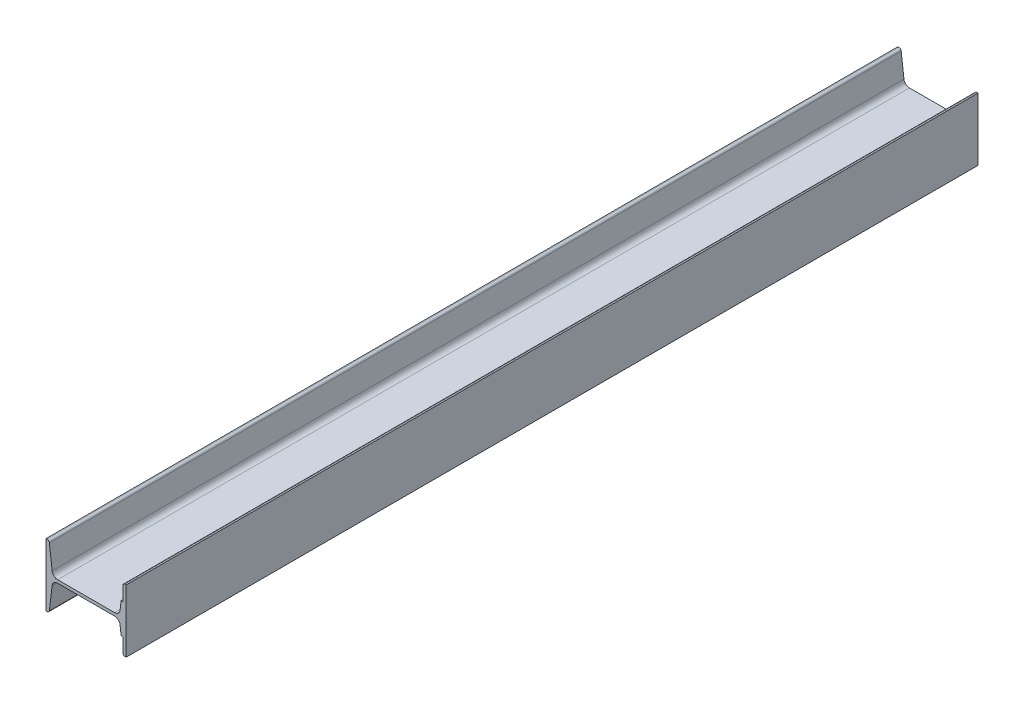
ISO-10303-21;
HEADER;
FILE_DESCRIPTION(('STEP AP214'),'2;1');
FILE_NAME('part.step','',(''),(''),'','','');
FILE_SCHEMA(('AUTOMOTIVE_DESIGN { 1 0 10303 214 1 1 1 1 }'));
ENDSEC;
DATA;
#1=APPLICATION_CONTEXT('core data for automotive mechanical design processes');
#2=APPLICATION_PROTOCOL_DEFINITION('international standard','automotive_design',2000,#1);
#3=PRODUCT_CONTEXT('',#1,'mechanical');
#4=PRODUCT('Part','Part','',(#3));
#5=PRODUCT_RELATED_PRODUCT_CATEGORY('part','',(#4));
#6=PRODUCT_DEFINITION_FORMATION('','',#4);
#7=PRODUCT_DEFINITION_CONTEXT('part definition',#1,'design');
#8=PRODUCT_DEFINITION('design','',#6,#7);
#9=PRODUCT_DEFINITION_SHAPE('','',#8);
#10=(LENGTH_UNIT() NAMED_UNIT(*) SI_UNIT(.MILLI.,.METRE.));
#11=(NAMED_UNIT(*) PLANE_ANGLE_UNIT() SI_UNIT($,.RADIAN.));
#12=(NAMED_UNIT(*) SI_UNIT($,.STERADIAN.) SOLID_ANGLE_UNIT());
#13=UNCERTAINTY_MEASURE_WITH_UNIT(LENGTH_MEASURE(1.E-05),#10,'distance_accuracy_value','');
#14=(GEOMETRIC_REPRESENTATION_CONTEXT(3) GLOBAL_UNCERTAINTY_ASSIGNED_CONTEXT((#13)) GLOBAL_UNIT_ASSIGNED_CONTEXT((#10,
#11,#12)) REPRESENTATION_CONTEXT('',''));
#15=CARTESIAN_POINT('',(0.,0.,0.));
#16=DIRECTION('',(0.,0.,1.));
#17=DIRECTION('',(1.,0.,0.));
#18=AXIS2_PLACEMENT_3D('',#15,#16,#17);
#19=CARTESIAN_POINT('',(112.531380140605,43.4991893124391,312.5));
#20=DIRECTION('',(0.,0.,1.));
#21=DIRECTION('',(1.,0.,0.));
#22=AXIS2_PLACEMENT_3D('',#19,#20,#21);
#23=CYLINDRICAL_SURFACE('',#22,3.3749999999963);
#24=CARTESIAN_POINT('',(112.531380140605,43.4991893124391,1587.5));
#25=DIRECTION('',(0.,0.,1.));
#26=DIRECTION('',(1.,0.,0.));
#27=AXIS2_PLACEMENT_3D('',#24,#25,#26);
#28=CIRCLE('',#27,3.3749999999963);
#29=CARTESIAN_POINT('',(112.531380140605,46.8741893124354,1587.5));
#30=VERTEX_POINT('',#29);
#31=CARTESIAN_POINT('',(109.709666996377,45.3508264074622,1587.5));
#32=VERTEX_POINT('',#31);
#33=EDGE_CURVE('E228',#30,#32,#28,.T.);
#34=ORIENTED_EDGE('',*,*,#33,.F.);
#35=DIRECTION('',(0.,0.,1.));
#36=VECTOR('',#35,1.);
#37=CARTESIAN_POINT('',(112.531380140605,46.8741893124354,312.5));
#38=LINE('',#37,#36);
#39=CARTESIAN_POINT('',(112.531380140605,46.8741893124354,312.5));
#40=VERTEX_POINT('',#39);
#41=EDGE_CURVE('E11',#40,#30,#38,.T.);
#42=ORIENTED_EDGE('',*,*,#41,.F.);
#43=CARTESIAN_POINT('',(112.531380140605,43.4991893124391,312.5));
#44=DIRECTION('',(0.,0.,1.));
#45=DIRECTION('',(1.,0.,0.));
#46=AXIS2_PLACEMENT_3D('',#43,#44,#45);
#47=CIRCLE('',#46,3.3749999999963);
#48=CARTESIAN_POINT('',(109.709666996377,45.3508264074622,312.5));
#49=VERTEX_POINT('',#48);
#50=EDGE_CURVE('E296',#40,#49,#47,.T.);
#51=ORIENTED_EDGE('',*,*,#50,.T.);
#52=DIRECTION('',(0.,0.,1.));
#53=VECTOR('',#52,1.);
#54=CARTESIAN_POINT('',(109.709666996377,45.3508264074622,312.5));
#55=LINE('',#54,#53);
#56=EDGE_CURVE('E38',#49,#32,#55,.T.);
#57=ORIENTED_EDGE('',*,*,#56,.T.);
#58=EDGE_LOOP('',(#34,#42,#51,#57));
#59=FACE_BOUND('',#58,.T.);
#60=ADVANCED_FACE('F35',(#59),#23,.T.);
#61=CARTESIAN_POINT('',(114.209666996383,46.8741893124354,312.5));
#62=DIRECTION('',(0.,1.,0.));
#63=DIRECTION('',(0.,0.,1.));
#64=AXIS2_PLACEMENT_3D('',#61,#62,#63);
#65=PLANE('',#64);
#66=DIRECTION('',(-1.,0.,0.));
#67=VECTOR('',#66,1.);
#68=CARTESIAN_POINT('',(114.209666996383,46.8741893124354,1587.5));
#69=LINE('',#68,#67);
#70=CARTESIAN_POINT('',(114.209666996383,46.8741893124354,1587.5));
#71=VERTEX_POINT('',#70);
#72=EDGE_CURVE('E294',#71,#30,#69,.T.);
#73=ORIENTED_EDGE('',*,*,#72,.F.);
#74=DIRECTION('',(0.,0.,1.));
#75=VECTOR('',#74,1.);
#76=CARTESIAN_POINT('',(114.209666996383,46.8741893124354,312.5));
#77=LINE('',#76,#75);
#78=CARTESIAN_POINT('',(114.209666996383,46.8741893124354,312.5));
#79=VERTEX_POINT('',#78);
#80=EDGE_CURVE('E44',#79,#71,#77,.T.);
#81=ORIENTED_EDGE('',*,*,#80,.F.);
#82=DIRECTION('',(-1.,0.,0.));
#83=VECTOR('',#82,1.);
#84=CARTESIAN_POINT('',(114.209666996383,46.8741893124354,312.5));
#85=LINE('',#84,#83);
#86=EDGE_CURVE('E218',#79,#40,#85,.T.);
#87=ORIENTED_EDGE('',*,*,#86,.T.);
#88=ORIENTED_EDGE('',*,*,#41,.T.);
#89=EDGE_LOOP('',(#73,#81,#87,#88));
#90=FACE_BOUND('',#89,.T.);
#91=ADVANCED_FACE('F340',(#90),#65,.T.);
#92=CARTESIAN_POINT('',(114.209666996383,-46.8758106875588,312.5));
#93=DIRECTION('',(1.,0.,0.));
#94=DIRECTION('',(0.,0.,-1.));
#95=AXIS2_PLACEMENT_3D('',#92,#93,#94);
#96=PLANE('',#95);
#97=DIRECTION('',(0.,1.,0.));
#98=VECTOR('',#97,1.);
#99=CARTESIAN_POINT('',(114.209666996383,-46.8758106875588,1587.5));
#100=LINE('',#99,#98);
#101=CARTESIAN_POINT('',(114.209666996383,-46.8758106875588,1587.5));
#102=VERTEX_POINT('',#101);
#103=EDGE_CURVE('E205',#102,#71,#100,.T.);
#104=ORIENTED_EDGE('',*,*,#103,.F.);
#105=DIRECTION('',(0.,0.,1.));
#106=VECTOR('',#105,1.);
#107=CARTESIAN_POINT('',(114.209666996383,-46.8758106875588,312.5));
#108=LINE('',#107,#106);
#109=CARTESIAN_POINT('',(114.209666996383,-46.8758106875588,312.5));
#110=VERTEX_POINT('',#109);
#111=EDGE_CURVE('E200',#110,#102,#108,.T.);
#112=ORIENTED_EDGE('',*,*,#111,.F.);
#113=DIRECTION('',(0.,1.,0.));
#114=VECTOR('',#113,1.);
#115=CARTESIAN_POINT('',(114.209666996383,-46.8758106875588,312.5));
#116=LINE('',#115,#114);
#117=EDGE_CURVE('E203',#110,#79,#116,.T.);
#118=ORIENTED_EDGE('',*,*,#117,.T.);
#119=ORIENTED_EDGE('',*,*,#80,.T.);
#120=EDGE_LOOP('',(#104,#112,#118,#119));
#121=FACE_BOUND('',#120,.T.);
#122=ADVANCED_FACE('F202',(#121),#96,.T.);
#123=CARTESIAN_POINT('',(112.531380140608,-46.8758106875588,312.5));
#124=DIRECTION('',(0.,-1.,0.));
#125=DIRECTION('',(0.,0.,-1.));
#126=AXIS2_PLACEMENT_3D('',#123,#124,#125);
#127=PLANE('',#126);
#128=DIRECTION('',(1.,0.,0.));
#129=VECTOR('',#128,1.);
#130=CARTESIAN_POINT('',(112.531380140608,-46.8758106875588,1587.5));
#131=LINE('',#130,#129);
#132=CARTESIAN_POINT('',(112.531380140608,-46.8758106875588,1587.5));
#133=VERTEX_POINT('',#132);
#134=EDGE_CURVE('E291',#133,#102,#131,.T.);
#135=ORIENTED_EDGE('',*,*,#134,.F.);
#136=DIRECTION('',(0.,0.,1.));
#137=VECTOR('',#136,1.);
#138=CARTESIAN_POINT('',(112.531380140608,-46.8758106875588,312.5));
#139=LINE('',#138,#137);
#140=CARTESIAN_POINT('',(112.531380140608,-46.8758106875588,312.5));
#141=VERTEX_POINT('',#140);
#142=EDGE_CURVE('E210',#141,#133,#139,.T.);
#143=ORIENTED_EDGE('',*,*,#142,.F.);
#144=DIRECTION('',(1.,0.,0.));
#145=VECTOR('',#144,1.);
#146=CARTESIAN_POINT('',(112.531380140608,-46.8758106875588,312.5));
#147=LINE('',#146,#145);
#148=EDGE_CURVE('E216',#141,#110,#147,.T.);
#149=ORIENTED_EDGE('',*,*,#148,.T.);
#150=ORIENTED_EDGE('',*,*,#111,.T.);
#151=EDGE_LOOP('',(#135,#143,#149,#150));
#152=FACE_BOUND('',#151,.T.);
#153=ADVANCED_FACE('F220',(#152),#127,.T.);
#154=CARTESIAN_POINT('',(112.531380140608,-43.5008106875588,312.5));
#155=DIRECTION('',(0.,0.,1.));
#156=DIRECTION('',(1.,0.,0.));
#157=AXIS2_PLACEMENT_3D('',#154,#155,#156);
#158=CYLINDRICAL_SURFACE('',#157,3.375);
#159=CARTESIAN_POINT('',(112.531380140608,-43.5008106875588,1587.5));
#160=DIRECTION('',(0.,0.,1.));
#161=DIRECTION('',(1.,0.,0.));
#162=AXIS2_PLACEMENT_3D('',#159,#160,#161);
#163=CIRCLE('',#162,3.375);
#164=CARTESIAN_POINT('',(109.709666996377,-45.3524477825839,1587.5));
#165=VERTEX_POINT('',#164);
#166=EDGE_CURVE('E288',#165,#133,#163,.T.);
#167=ORIENTED_EDGE('',*,*,#166,.F.);
#168=DIRECTION('',(0.,0.,1.));
#169=VECTOR('',#168,1.);
#170=CARTESIAN_POINT('',(109.709666996377,-45.3524477825839,312.5));
#171=LINE('',#170,#169);
#172=CARTESIAN_POINT('',(109.709666996377,-45.3524477825839,312.5));
#173=VERTEX_POINT('',#172);
#174=EDGE_CURVE('E300',#173,#165,#171,.T.);
#175=ORIENTED_EDGE('',*,*,#174,.F.);
#176=CARTESIAN_POINT('',(112.531380140608,-43.5008106875588,312.5));
#177=DIRECTION('',(0.,0.,1.));
#178=DIRECTION('',(1.,0.,0.));
#179=AXIS2_PLACEMENT_3D('',#176,#177,#178);
#180=CIRCLE('',#179,3.375);
#181=EDGE_CURVE('E221',#173,#141,#180,.T.);
#182=ORIENTED_EDGE('',*,*,#181,.T.);
#183=ORIENTED_EDGE('',*,*,#142,.T.);
#184=EDGE_LOOP('',(#167,#175,#182,#183));
#185=FACE_BOUND('',#184,.T.);
#186=ADVANCED_FACE('F353',(#185),#158,.T.);
#187=CARTESIAN_POINT('',(109.709666996377,-22.5008106875744,312.5));
#188=DIRECTION('',(-1.,0.,0.));
#189=DIRECTION('',(0.,0.,1.));
#190=AXIS2_PLACEMENT_3D('',#187,#188,#189);
#191=PLANE('',#190);
#192=DIRECTION('',(0.,-1.,0.));
#193=VECTOR('',#192,1.);
#194=CARTESIAN_POINT('',(109.709666996377,-22.5008106875744,1587.5));
#195=LINE('',#194,#193);
#196=CARTESIAN_POINT('',(109.709666996377,-22.5008106875744,1587.5));
#197=VERTEX_POINT('',#196);
#198=EDGE_CURVE('E285',#197,#165,#195,.T.);
#199=ORIENTED_EDGE('',*,*,#198,.F.);
#200=DIRECTION('',(0.,0.,1.));
#201=VECTOR('',#200,1.);
#202=CARTESIAN_POINT('',(109.709666996377,-22.5008106875744,312.5));
#203=LINE('',#202,#201);
#204=CARTESIAN_POINT('',(109.709666996377,-22.5008106875744,312.5));
#205=VERTEX_POINT('',#204);
#206=EDGE_CURVE('E302',#205,#197,#203,.T.);
#207=ORIENTED_EDGE('',*,*,#206,.F.);
#208=DIRECTION('',(0.,-1.,0.));
#209=VECTOR('',#208,1.);
#210=CARTESIAN_POINT('',(109.709666996377,-22.5008106875744,312.5));
#211=LINE('',#210,#209);
#212=EDGE_CURVE('E223',#205,#173,#211,.T.);
#213=ORIENTED_EDGE('',*,*,#212,.T.);
#214=ORIENTED_EDGE('',*,*,#174,.T.);
#215=EDGE_LOOP('',(#199,#207,#213,#214));
#216=FACE_BOUND('',#215,.T.);
#217=ADVANCED_FACE('F356',(#216),#191,.T.);
#218=CARTESIAN_POINT('',(106.612166996365,-22.5008106875744,312.5));
#219=DIRECTION('',(0.,-1.,0.));
#220=DIRECTION('',(0.,0.,-1.));
#221=AXIS2_PLACEMENT_3D('',#218,#219,#220);
#222=PLANE('',#221);
#223=DIRECTION('',(1.,0.,0.));
#224=VECTOR('',#223,1.);
#225=CARTESIAN_POINT('',(106.612166996365,-22.5008106875744,1587.5));
#226=LINE('',#225,#224);
#227=CARTESIAN_POINT('',(106.612166996365,-22.5008106875744,1587.5));
#228=VERTEX_POINT('',#227);
#229=EDGE_CURVE('E282',#228,#197,#226,.T.);
#230=ORIENTED_EDGE('',*,*,#229,.F.);
#231=DIRECTION('',(0.,0.,1.));
#232=VECTOR('',#231,1.);
#233=CARTESIAN_POINT('',(106.612166996365,-22.5008106875744,312.5));
#234=LINE('',#233,#232);
#235=CARTESIAN_POINT('',(106.612166996365,-22.5008106875744,312.5));
#236=VERTEX_POINT('',#235);
#237=EDGE_CURVE('E304',#236,#228,#234,.T.);
#238=ORIENTED_EDGE('',*,*,#237,.F.);
#239=DIRECTION('',(1.,0.,0.));
#240=VECTOR('',#239,1.);
#241=CARTESIAN_POINT('',(106.612166996365,-22.5008106875744,312.5));
#242=LINE('',#241,#240);
#243=EDGE_CURVE('E646',#236,#205,#242,.T.);
#244=ORIENTED_EDGE('',*,*,#243,.T.);
#245=ORIENTED_EDGE('',*,*,#206,.T.);
#246=EDGE_LOOP('',(#230,#238,#244,#245));
#247=FACE_BOUND('',#246,.T.);
#248=ADVANCED_FACE('F360',(#247),#222,.T.);
#249=CARTESIAN_POINT('',(105.054213227965,-9.51786261747592,312.5));
#250=DIRECTION('',(-0.99287683848703,-0.119145220617527,0.));
#251=DIRECTION('',(0.119145220617527,-0.992876838487031,0.));
#252=AXIS2_PLACEMENT_3D('',#249,#250,#251);
#253=PLANE('',#252);
#254=DIRECTION('',(0.119145220617527,-0.99287683848703,0.));
#255=VECTOR('',#254,1.);
#256=CARTESIAN_POINT('',(105.054213227965,-9.51786261747592,1587.5));
#257=LINE('',#256,#255);
#258=CARTESIAN_POINT('',(105.054213227965,-9.51786261747592,1587.5));
#259=VERTEX_POINT('',#258);
#260=EDGE_CURVE('E279',#259,#228,#257,.T.);
#261=ORIENTED_EDGE('',*,*,#260,.F.);
#262=DIRECTION('',(0.,0.,1.));
#263=VECTOR('',#262,1.);
#264=CARTESIAN_POINT('',(105.054213227965,-9.51786261747592,312.5));
#265=LINE('',#264,#263);
#266=CARTESIAN_POINT('',(105.054213227965,-9.51786261747592,312.5));
#267=VERTEX_POINT('',#266);
#268=EDGE_CURVE('E306',#267,#259,#265,.T.);
#269=ORIENTED_EDGE('',*,*,#268,.F.);
#270=DIRECTION('',(0.119145220617527,-0.99287683848703,0.));
#271=VECTOR('',#270,1.);
#272=CARTESIAN_POINT('',(105.054213227965,-9.51786261747592,312.5));
#273=LINE('',#272,#271);
#274=EDGE_CURVE('E650',#267,#236,#273,.T.);
#275=ORIENTED_EDGE('',*,*,#274,.T.);
#276=ORIENTED_EDGE('',*,*,#237,.T.);
#277=EDGE_LOOP('',(#261,#269,#275,#276));
#278=FACE_BOUND('',#277,.T.);
#279=ADVANCED_FACE('F364',(#278),#253,.T.);
#280=CARTESIAN_POINT('',(96.8629793104312,-10.5008106875724,312.5));
#281=DIRECTION('',(0.,0.,1.));
#282=DIRECTION('',(1.,0.,0.));
#283=AXIS2_PLACEMENT_3D('',#280,#281,#282);
#284=CYLINDRICAL_SURFACE('',#283,8.2500000000162);
#285=CARTESIAN_POINT('',(96.8629793104312,-10.5008106875724,1587.5));
#286=DIRECTION('',(0.,0.,-1.));
#287=DIRECTION('',(-1.,0.,0.));
#288=AXIS2_PLACEMENT_3D('',#285,#286,#287);
#289=CIRCLE('',#288,8.2500000000162);
#290=CARTESIAN_POINT('',(96.8629793104312,-2.25081068755624,1587.5));
#291=VERTEX_POINT('',#290);
#292=EDGE_CURVE('E276',#291,#259,#289,.T.);
#293=ORIENTED_EDGE('',*,*,#292,.F.);
#294=DIRECTION('',(0.,0.,1.));
#295=VECTOR('',#294,1.);
#296=CARTESIAN_POINT('',(96.8629793104312,-2.25081068755624,312.5));
#297=LINE('',#296,#295);
#298=CARTESIAN_POINT('',(96.8629793104312,-2.25081068755624,312.5));
#299=VERTEX_POINT('',#298);
#300=EDGE_CURVE('E308',#299,#291,#297,.T.);
#301=ORIENTED_EDGE('',*,*,#300,.F.);
#302=CARTESIAN_POINT('',(96.8629793104312,-10.5008106875724,312.5));
#303=DIRECTION('',(0.,0.,-1.));
#304=DIRECTION('',(-1.,0.,0.));
#305=AXIS2_PLACEMENT_3D('',#302,#303,#304);
#306=CIRCLE('',#305,8.2500000000162);
#307=EDGE_CURVE('E639',#299,#267,#306,.T.);
#308=ORIENTED_EDGE('',*,*,#307,.T.);
#309=ORIENTED_EDGE('',*,*,#268,.T.);
#310=EDGE_LOOP('',(#293,#301,#308,#309));
#311=FACE_BOUND('',#310,.T.);
#312=ADVANCED_FACE('F368',(#311),#284,.F.);
#313=CARTESIAN_POINT('',(11.5563546823102,-2.25081068755624,312.5));
#314=DIRECTION('',(0.,-1.,0.));
#315=DIRECTION('',(0.,0.,-1.));
#316=AXIS2_PLACEMENT_3D('',#313,#314,#315);
#317=PLANE('',#316);
#318=DIRECTION('',(1.,0.,0.));
#319=VECTOR('',#318,1.);
#320=CARTESIAN_POINT('',(11.5563546823102,-2.25081068755624,1587.5));
#321=LINE('',#320,#319);
#322=CARTESIAN_POINT('',(11.5563546823102,-2.25081068755624,1587.5));
#323=VERTEX_POINT('',#322);
#324=EDGE_CURVE('E273',#323,#291,#321,.T.);
#325=ORIENTED_EDGE('',*,*,#324,.F.);
#326=DIRECTION('',(0.,0.,1.));
#327=VECTOR('',#326,1.);
#328=CARTESIAN_POINT('',(11.5563546823102,-2.25081068755624,312.5));
#329=LINE('',#328,#327);
#330=CARTESIAN_POINT('',(11.5563546823102,-2.25081068755624,312.5));
#331=VERTEX_POINT('',#330);
#332=EDGE_CURVE('E310',#331,#323,#329,.T.);
#333=ORIENTED_EDGE('',*,*,#332,.F.);
#334=DIRECTION('',(1.,0.,0.));
#335=VECTOR('',#334,1.);
#336=CARTESIAN_POINT('',(11.5563546823102,-2.25081068755624,312.5));
#337=LINE('',#336,#335);
#338=EDGE_CURVE('E635',#331,#299,#337,.T.);
#339=ORIENTED_EDGE('',*,*,#338,.T.);
#340=ORIENTED_EDGE('',*,*,#300,.T.);
#341=EDGE_LOOP('',(#325,#333,#339,#340));
#342=FACE_BOUND('',#341,.T.);
#343=ADVANCED_FACE('F372',(#342),#317,.T.);
#344=CARTESIAN_POINT('',(11.5563546823102,-10.5008106875554,312.5));
#345=DIRECTION('',(0.,0.,1.));
#346=DIRECTION('',(1.,0.,0.));
#347=AXIS2_PLACEMENT_3D('',#344,#345,#346);
#348=CYLINDRICAL_SURFACE('',#347,8.24999999999917);
#349=CARTESIAN_POINT('',(11.5563546823102,-10.5008106875554,1587.5));
#350=DIRECTION('',(0.,0.,-1.));
#351=DIRECTION('',(-1.,0.,0.));
#352=AXIS2_PLACEMENT_3D('',#349,#350,#351);
#353=CIRCLE('',#352,8.24999999999917);
#354=CARTESIAN_POINT('',(3.36512076479385,-9.51786261745377,1587.5));
#355=VERTEX_POINT('',#354);
#356=EDGE_CURVE('E270',#355,#323,#353,.T.);
#357=ORIENTED_EDGE('',*,*,#356,.F.);
#358=DIRECTION('',(0.,0.,1.));
#359=VECTOR('',#358,1.);
#360=CARTESIAN_POINT('',(3.36512076479385,-9.51786261745377,312.5));
#361=LINE('',#360,#359);
#362=CARTESIAN_POINT('',(3.36512076479385,-9.51786261745377,312.5));
#363=VERTEX_POINT('',#362);
#364=EDGE_CURVE('E312',#363,#355,#361,.T.);
#365=ORIENTED_EDGE('',*,*,#364,.F.);
#366=CARTESIAN_POINT('',(11.5563546823102,-10.5008106875554,312.5));
#367=DIRECTION('',(0.,0.,-1.));
#368=DIRECTION('',(-1.,0.,0.));
#369=AXIS2_PLACEMENT_3D('',#366,#367,#368);
#370=CIRCLE('',#369,8.24999999999917);
#371=EDGE_CURVE('E656',#363,#331,#370,.T.);
#372=ORIENTED_EDGE('',*,*,#371,.T.);
#373=ORIENTED_EDGE('',*,*,#332,.T.);
#374=EDGE_LOOP('',(#357,#365,#372,#373));
#375=FACE_BOUND('',#374,.T.);
#376=ADVANCED_FACE('F376',(#375),#348,.F.);
#377=CARTESIAN_POINT('',(-0.761086817967506,-43.9029258071431,312.5));
#378=DIRECTION('',(0.992876838486927,-0.119145220618392,0.));
#379=DIRECTION('',(0.119145220618392,0.992876838486927,0.));
#380=AXIS2_PLACEMENT_3D('',#377,#378,#379);
#381=PLANE('',#380);
#382=DIRECTION('',(0.119145220618392,0.992876838486927,0.));
#383=VECTOR('',#382,1.);
#384=CARTESIAN_POINT('',(-0.761086817967506,-43.9029258071431,1587.5));
#385=LINE('',#384,#383);
#386=CARTESIAN_POINT('',(-0.761086817967506,-43.9029258071431,1587.5));
#387=VERTEX_POINT('',#386);
#388=EDGE_CURVE('E267',#387,#355,#385,.T.);
#389=ORIENTED_EDGE('',*,*,#388,.F.);
#390=DIRECTION('',(0.,0.,1.));
#391=VECTOR('',#390,1.);
#392=CARTESIAN_POINT('',(-0.761086817967506,-43.9029258071431,312.5));
#393=LINE('',#392,#391);
#394=CARTESIAN_POINT('',(-0.761086817967506,-43.9029258071431,312.5));
#395=VERTEX_POINT('',#394);
#396=EDGE_CURVE('E314',#395,#387,#393,.T.);
#397=ORIENTED_EDGE('',*,*,#396,.F.);
#398=DIRECTION('',(0.119145220618392,0.992876838486927,0.));
#399=VECTOR('',#398,1.);
#400=CARTESIAN_POINT('',(-0.761086817967506,-43.9029258071431,312.5));
#401=LINE('',#400,#399);
#402=EDGE_CURVE('E628',#395,#363,#401,.T.);
#403=ORIENTED_EDGE('',*,*,#402,.T.);
#404=ORIENTED_EDGE('',*,*,#364,.T.);
#405=EDGE_LOOP('',(#389,#397,#403,#404));
#406=FACE_BOUND('',#405,.T.);
#407=ADVANCED_FACE('F380',(#406),#381,.T.);
#408=CARTESIAN_POINT('',(-4.11204614786402,-43.5008106875557,312.5));
#409=DIRECTION('',(0.,0.,1.));
#410=DIRECTION('',(1.,0.,0.));
#411=AXIS2_PLACEMENT_3D('',#408,#409,#410);
#412=CYLINDRICAL_SURFACE('',#411,3.37500000000316);
#413=CARTESIAN_POINT('',(-4.11204614786402,-43.5008106875557,1587.5));
#414=DIRECTION('',(0.,0.,1.));
#415=DIRECTION('',(1.,0.,0.));
#416=AXIS2_PLACEMENT_3D('',#413,#414,#415);
#417=CIRCLE('',#416,3.37500000000316);
#418=CARTESIAN_POINT('',(-4.11204614786402,-46.8758106875588,1587.5));
#419=VERTEX_POINT('',#418);
#420=EDGE_CURVE('E264',#419,#387,#417,.T.);
#421=ORIENTED_EDGE('',*,*,#420,.F.);
#422=DIRECTION('',(0.,0.,1.));
#423=VECTOR('',#422,1.);
#424=CARTESIAN_POINT('',(-4.11204614786402,-46.8758106875588,312.5));
#425=LINE('',#424,#423);
#426=CARTESIAN_POINT('',(-4.11204614786402,-46.8758106875588,312.5));
#427=VERTEX_POINT('',#426);
#428=EDGE_CURVE('E316',#427,#419,#425,.T.);
#429=ORIENTED_EDGE('',*,*,#428,.F.);
#430=CARTESIAN_POINT('',(-4.11204614786402,-43.5008106875557,312.5));
#431=DIRECTION('',(0.,0.,1.));
#432=DIRECTION('',(1.,0.,0.));
#433=AXIS2_PLACEMENT_3D('',#430,#431,#432);
#434=CIRCLE('',#433,3.37500000000316);
#435=EDGE_CURVE('E624',#427,#395,#434,.T.);
#436=ORIENTED_EDGE('',*,*,#435,.T.);
#437=ORIENTED_EDGE('',*,*,#396,.T.);
#438=EDGE_LOOP('',(#421,#429,#436,#437));
#439=FACE_BOUND('',#438,.T.);
#440=ADVANCED_FACE('F384',(#439),#412,.T.);
#441=CARTESIAN_POINT('',(-5.79033300361652,-46.8758106875588,312.5));
#442=DIRECTION('',(0.,-1.,0.));
#443=DIRECTION('',(0.,0.,-1.));
#444=AXIS2_PLACEMENT_3D('',#441,#442,#443);
#445=PLANE('',#444);
#446=DIRECTION('',(1.,0.,0.));
#447=VECTOR('',#446,1.);
#448=CARTESIAN_POINT('',(-5.79033300361652,-46.8758106875588,1587.5));
#449=LINE('',#448,#447);
#450=CARTESIAN_POINT('',(-5.79033300361652,-46.8758106875588,1587.5));
#451=VERTEX_POINT('',#450);
#452=EDGE_CURVE('E261',#451,#419,#449,.T.);
#453=ORIENTED_EDGE('',*,*,#452,.F.);
#454=DIRECTION('',(0.,0.,1.));
#455=VECTOR('',#454,1.);
#456=CARTESIAN_POINT('',(-5.79033300361652,-46.8758106875588,312.5));
#457=LINE('',#456,#455);
#458=CARTESIAN_POINT('',(-5.79033300361652,-46.8758106875588,312.5));
#459=VERTEX_POINT('',#458);
#460=EDGE_CURVE('E318',#459,#451,#457,.T.);
#461=ORIENTED_EDGE('',*,*,#460,.F.);
#462=DIRECTION('',(1.,0.,0.));
#463=VECTOR('',#462,1.);
#464=CARTESIAN_POINT('',(-5.79033300361652,-46.8758106875588,312.5));
#465=LINE('',#464,#463);
#466=EDGE_CURVE('E660',#459,#427,#465,.T.);
#467=ORIENTED_EDGE('',*,*,#466,.T.);
#468=ORIENTED_EDGE('',*,*,#428,.T.);
#469=EDGE_LOOP('',(#453,#461,#467,#468));
#470=FACE_BOUND('',#469,.T.);
#471=ADVANCED_FACE('F388',(#470),#445,.T.);
#472=CARTESIAN_POINT('',(-5.79033300361653,46.8741893124354,312.5));
#473=DIRECTION('',(-1.,0.,0.));
#474=DIRECTION('',(0.,-1.,0.));
#475=AXIS2_PLACEMENT_3D('',#472,#473,#474);
#476=PLANE('',#475);
#477=DIRECTION('',(0.,-1.,0.));
#478=VECTOR('',#477,1.);
#479=CARTESIAN_POINT('',(-5.79033300361653,46.8741893124354,1587.5));
#480=LINE('',#479,#478);
#481=CARTESIAN_POINT('',(-5.79033300361653,46.8741893124354,1587.5));
#482=VERTEX_POINT('',#481);
#483=EDGE_CURVE('E258',#482,#451,#480,.T.);
#484=ORIENTED_EDGE('',*,*,#483,.F.);
#485=DIRECTION('',(0.,0.,1.));
#486=VECTOR('',#485,1.);
#487=CARTESIAN_POINT('',(-5.79033300361653,46.8741893124354,312.5));
#488=LINE('',#487,#486);
#489=CARTESIAN_POINT('',(-5.79033300361653,46.8741893124354,312.5));
#490=VERTEX_POINT('',#489);
#491=EDGE_CURVE('E320',#490,#482,#488,.T.);
#492=ORIENTED_EDGE('',*,*,#491,.F.);
#493=DIRECTION('',(0.,-1.,0.));
#494=VECTOR('',#493,1.);
#495=CARTESIAN_POINT('',(-5.79033300361653,46.8741893124354,312.5));
#496=LINE('',#495,#494);
#497=EDGE_CURVE('E617',#490,#459,#496,.T.);
#498=ORIENTED_EDGE('',*,*,#497,.T.);
#499=ORIENTED_EDGE('',*,*,#460,.T.);
#500=EDGE_LOOP('',(#484,#492,#498,#499));
#501=FACE_BOUND('',#500,.T.);
#502=ADVANCED_FACE('F392',(#501),#476,.T.);
#503=CARTESIAN_POINT('',(-4.11204614786715,46.8741893124354,312.5));
#504=DIRECTION('',(0.,1.,0.));
#505=DIRECTION('',(0.,0.,1.));
#506=AXIS2_PLACEMENT_3D('',#503,#504,#505);
#507=PLANE('',#506);
#508=DIRECTION('',(-1.,0.,0.));
#509=VECTOR('',#508,1.);
#510=CARTESIAN_POINT('',(-4.11204614786715,46.8741893124354,1587.5));
#511=LINE('',#510,#509);
#512=CARTESIAN_POINT('',(-4.11204614786715,46.8741893124354,1587.5));
#513=VERTEX_POINT('',#512);
#514=EDGE_CURVE('E255',#513,#482,#511,.T.);
#515=ORIENTED_EDGE('',*,*,#514,.F.);
#516=DIRECTION('',(0.,0.,1.));
#517=VECTOR('',#516,1.);
#518=CARTESIAN_POINT('',(-4.11204614786715,46.8741893124354,312.5));
#519=LINE('',#518,#517);
#520=CARTESIAN_POINT('',(-4.11204614786715,46.8741893124354,312.5));
#521=VERTEX_POINT('',#520);
#522=EDGE_CURVE('E322',#521,#513,#519,.T.);
#523=ORIENTED_EDGE('',*,*,#522,.F.);
#524=DIRECTION('',(-1.,0.,0.));
#525=VECTOR('',#524,1.);
#526=CARTESIAN_POINT('',(-4.11204614786715,46.8741893124354,312.5));
#527=LINE('',#526,#525);
#528=EDGE_CURVE('E613',#521,#490,#527,.T.);
#529=ORIENTED_EDGE('',*,*,#528,.T.);
#530=ORIENTED_EDGE('',*,*,#491,.T.);
#531=EDGE_LOOP('',(#515,#523,#529,#530));
#532=FACE_BOUND('',#531,.T.);
#533=ADVANCED_FACE('F396',(#532),#507,.T.);
#534=CARTESIAN_POINT('',(-4.11204614786715,43.4991893124338,312.5));
#535=DIRECTION('',(0.,0.,1.));
#536=DIRECTION('',(1.,0.,0.));
#537=AXIS2_PLACEMENT_3D('',#534,#535,#536);
#538=CYLINDRICAL_SURFACE('',#537,3.37500000000158);
#539=CARTESIAN_POINT('',(-4.11204614786715,43.4991893124338,1587.5));
#540=DIRECTION('',(0.,0.,1.));
#541=DIRECTION('',(1.,0.,0.));
#542=AXIS2_PLACEMENT_3D('',#539,#540,#541);
#543=CIRCLE('',#542,3.37500000000158);
#544=CARTESIAN_POINT('',(-0.76108681797226,43.9013044320216,1587.5));
#545=VERTEX_POINT('',#544);
#546=EDGE_CURVE('E252',#545,#513,#543,.T.);
#547=ORIENTED_EDGE('',*,*,#546,.F.);
#548=DIRECTION('',(0.,0.,1.));
#549=VECTOR('',#548,1.);
#550=CARTESIAN_POINT('',(-0.76108681797226,43.9013044320216,312.5));
#551=LINE('',#550,#549);
#552=CARTESIAN_POINT('',(-0.76108681797226,43.9013044320216,312.5));
#553=VERTEX_POINT('',#552);
#554=EDGE_CURVE('E324',#553,#545,#551,.T.);
#555=ORIENTED_EDGE('',*,*,#554,.F.);
#556=CARTESIAN_POINT('',(-4.11204614786715,43.4991893124338,312.5));
#557=DIRECTION('',(0.,0.,1.));
#558=DIRECTION('',(1.,0.,0.));
#559=AXIS2_PLACEMENT_3D('',#556,#557,#558);
#560=CIRCLE('',#559,3.37500000000158);
#561=EDGE_CURVE('E664',#553,#521,#560,.T.);
#562=ORIENTED_EDGE('',*,*,#561,.T.);
#563=ORIENTED_EDGE('',*,*,#522,.T.);
#564=EDGE_LOOP('',(#547,#555,#562,#563));
#565=FACE_BOUND('',#564,.T.);
#566=ADVANCED_FACE('F400',(#565),#538,.T.);
#567=CARTESIAN_POINT('',(3.36512076479408,9.51624124233116,312.5));
#568=DIRECTION('',(0.99287683848691,0.11914522061853,0.));
#569=DIRECTION('',(-0.11914522061853,0.99287683848691,0.));
#570=AXIS2_PLACEMENT_3D('',#567,#568,#569);
#571=PLANE('',#570);
#572=DIRECTION('',(-0.11914522061853,0.99287683848691,0.));
#573=VECTOR('',#572,1.);
#574=CARTESIAN_POINT('',(3.36512076479408,9.51624124233116,1587.5));
#575=LINE('',#574,#573);
#576=CARTESIAN_POINT('',(3.36512076479408,9.51624124233115,1587.5));
#577=VERTEX_POINT('',#576);
#578=EDGE_CURVE('E249',#577,#545,#575,.T.);
#579=ORIENTED_EDGE('',*,*,#578,.F.);
#580=DIRECTION('',(0.,0.,1.));
#581=VECTOR('',#580,1.);
#582=CARTESIAN_POINT('',(3.36512076479408,9.51624124233115,312.5));
#583=LINE('',#582,#581);
#584=CARTESIAN_POINT('',(3.36512076479408,9.51624124233115,312.5));
#585=VERTEX_POINT('',#584);
#586=EDGE_CURVE('E326',#585,#577,#583,.T.);
#587=ORIENTED_EDGE('',*,*,#586,.F.);
#588=DIRECTION('',(-0.11914522061853,0.99287683848691,0.));
#589=VECTOR('',#588,1.);
#590=CARTESIAN_POINT('',(3.36512076479408,9.51624124233116,312.5));
#591=LINE('',#590,#589);
#592=EDGE_CURVE('E606',#585,#553,#591,.T.);
#593=ORIENTED_EDGE('',*,*,#592,.T.);
#594=ORIENTED_EDGE('',*,*,#554,.T.);
#595=EDGE_LOOP('',(#579,#587,#593,#594));
#596=FACE_BOUND('',#595,.T.);
#597=ADVANCED_FACE('F404',(#596),#571,.T.);
#598=CARTESIAN_POINT('',(11.5563546823094,10.4991893124338,312.5));
#599=DIRECTION('',(0.,0.,1.));
#600=DIRECTION('',(1.,0.,0.));
#601=AXIS2_PLACEMENT_3D('',#598,#599,#600);
#602=CYLINDRICAL_SURFACE('',#601,8.24999999999834);
#603=CARTESIAN_POINT('',(11.5563546823094,10.4991893124338,1587.5));
#604=DIRECTION('',(0.,0.,-1.));
#605=DIRECTION('',(-1.,0.,0.));
#606=AXIS2_PLACEMENT_3D('',#603,#604,#605);
#607=CIRCLE('',#606,8.24999999999834);
#608=CARTESIAN_POINT('',(11.5563546823094,2.2491893124355,1587.5));
#609=VERTEX_POINT('',#608);
#610=EDGE_CURVE('E246',#609,#577,#607,.T.);
#611=ORIENTED_EDGE('',*,*,#610,.F.);
#612=DIRECTION('',(0.,0.,1.));
#613=VECTOR('',#612,1.);
#614=CARTESIAN_POINT('',(11.5563546823094,2.2491893124355,312.5));
#615=LINE('',#614,#613);
#616=CARTESIAN_POINT('',(11.5563546823094,2.2491893124355,312.5));
#617=VERTEX_POINT('',#616);
#618=EDGE_CURVE('E328',#617,#609,#615,.T.);
#619=ORIENTED_EDGE('',*,*,#618,.F.);
#620=CARTESIAN_POINT('',(11.5563546823094,10.4991893124338,312.5));
#621=DIRECTION('',(0.,0.,-1.));
#622=DIRECTION('',(-1.,0.,0.));
#623=AXIS2_PLACEMENT_3D('',#620,#621,#622);
#624=CIRCLE('',#623,8.24999999999834);
#625=EDGE_CURVE('E602',#617,#585,#624,.T.);
#626=ORIENTED_EDGE('',*,*,#625,.T.);
#627=ORIENTED_EDGE('',*,*,#586,.T.);
#628=EDGE_LOOP('',(#611,#619,#626,#627));
#629=FACE_BOUND('',#628,.T.);
#630=ADVANCED_FACE('F408',(#629),#602,.F.);
#631=CARTESIAN_POINT('',(96.8629793104304,2.24918931243551,312.5));
#632=DIRECTION('',(0.,1.,0.));
#633=DIRECTION('',(-1.,0.,0.));
#634=AXIS2_PLACEMENT_3D('',#631,#632,#633);
#635=PLANE('',#634);
#636=DIRECTION('',(-1.,0.,0.));
#637=VECTOR('',#636,1.);
#638=CARTESIAN_POINT('',(96.8629793104304,2.24918931243551,1587.5));
#639=LINE('',#638,#637);
#640=CARTESIAN_POINT('',(96.8629793104304,2.24918931243551,1587.5));
#641=VERTEX_POINT('',#640);
#642=EDGE_CURVE('E243',#641,#609,#639,.T.);
#643=ORIENTED_EDGE('',*,*,#642,.F.);
#644=DIRECTION('',(0.,0.,1.));
#645=VECTOR('',#644,1.);
#646=CARTESIAN_POINT('',(96.8629793104304,2.24918931243551,312.5));
#647=LINE('',#646,#645);
#648=CARTESIAN_POINT('',(96.8629793104304,2.24918931243551,312.5));
#649=VERTEX_POINT('',#648);
#650=EDGE_CURVE('E330',#649,#641,#647,.T.);
#651=ORIENTED_EDGE('',*,*,#650,.F.);
#652=DIRECTION('',(-1.,0.,0.));
#653=VECTOR('',#652,1.);
#654=CARTESIAN_POINT('',(96.8629793104304,2.24918931243551,312.5));
#655=LINE('',#654,#653);
#656=EDGE_CURVE('E668',#649,#617,#655,.T.);
#657=ORIENTED_EDGE('',*,*,#656,.T.);
#658=ORIENTED_EDGE('',*,*,#618,.T.);
#659=EDGE_LOOP('',(#643,#651,#657,#658));
#660=FACE_BOUND('',#659,.T.);
#661=ADVANCED_FACE('F412',(#660),#635,.T.);
#662=CARTESIAN_POINT('',(96.8629793104304,10.4991893124355,312.5));
#663=DIRECTION('',(0.,0.,1.));
#664=DIRECTION('',(1.,0.,0.));
#665=AXIS2_PLACEMENT_3D('',#662,#663,#664);
#666=CYLINDRICAL_SURFACE('',#665,8.25);
#667=CARTESIAN_POINT('',(96.8629793104304,10.4991893124355,1587.5));
#668=DIRECTION('',(0.,0.,-1.));
#669=DIRECTION('',(-1.,0.,0.));
#670=AXIS2_PLACEMENT_3D('',#667,#668,#669);
#671=CIRCLE('',#670,8.25);
#672=CARTESIAN_POINT('',(105.054213227266,9.51624123665746,1587.5));
#673=VERTEX_POINT('',#672);
#674=EDGE_CURVE('E240',#673,#641,#671,.T.);
#675=ORIENTED_EDGE('',*,*,#674,.F.);
#676=DIRECTION('',(0.,0.,1.));
#677=VECTOR('',#676,1.);
#678=CARTESIAN_POINT('',(105.054213227266,9.51624123665746,312.5));
#679=LINE('',#678,#677);
#680=CARTESIAN_POINT('',(105.054213227266,9.51624123665746,312.5));
#681=VERTEX_POINT('',#680);
#682=EDGE_CURVE('E332',#681,#673,#679,.T.);
#683=ORIENTED_EDGE('',*,*,#682,.F.);
#684=CARTESIAN_POINT('',(96.8629793104304,10.4991893124355,312.5));
#685=DIRECTION('',(0.,0.,-1.));
#686=DIRECTION('',(-1.,0.,0.));
#687=AXIS2_PLACEMENT_3D('',#684,#685,#686);
#688=CIRCLE('',#687,8.25);
#689=EDGE_CURVE('E595',#681,#649,#688,.T.);
#690=ORIENTED_EDGE('',*,*,#689,.T.);
#691=ORIENTED_EDGE('',*,*,#650,.T.);
#692=EDGE_LOOP('',(#675,#683,#690,#691));
#693=FACE_BOUND('',#692,.T.);
#694=ADVANCED_FACE('F416',(#693),#666,.F.);
#695=CARTESIAN_POINT('',(106.649478564355,22.4991893124355,312.5));
#696=DIRECTION('',(-0.99253542309204,0.121956688654231,0.));
#697=DIRECTION('',(-0.121956688654231,-0.99253542309204,0.));
#698=AXIS2_PLACEMENT_3D('',#695,#696,#697);
#699=PLANE('',#698);
#700=DIRECTION('',(-0.121956688654231,-0.99253542309204,0.));
#701=VECTOR('',#700,1.);
#702=CARTESIAN_POINT('',(106.649478564355,22.4991893124355,1587.5));
#703=LINE('',#702,#701);
#704=CARTESIAN_POINT('',(106.649478564355,22.4991893124355,1587.5));
#705=VERTEX_POINT('',#704);
#706=EDGE_CURVE('E237',#705,#673,#703,.T.);
#707=ORIENTED_EDGE('',*,*,#706,.F.);
#708=DIRECTION('',(0.,0.,1.));
#709=VECTOR('',#708,1.);
#710=CARTESIAN_POINT('',(106.649478564355,22.4991893124355,312.5));
#711=LINE('',#710,#709);
#712=CARTESIAN_POINT('',(106.649478564355,22.4991893124355,312.5));
#713=VERTEX_POINT('',#712);
#714=EDGE_CURVE('E334',#713,#705,#711,.T.);
#715=ORIENTED_EDGE('',*,*,#714,.F.);
#716=DIRECTION('',(-0.121956688654231,-0.99253542309204,0.));
#717=VECTOR('',#716,1.);
#718=CARTESIAN_POINT('',(106.649478564355,22.4991893124355,312.5));
#719=LINE('',#718,#717);
#720=EDGE_CURVE('E591',#713,#681,#719,.T.);
#721=ORIENTED_EDGE('',*,*,#720,.T.);
#722=ORIENTED_EDGE('',*,*,#682,.T.);
#723=EDGE_LOOP('',(#707,#715,#721,#722));
#724=FACE_BOUND('',#723,.T.);
#725=ADVANCED_FACE('F420',(#724),#699,.T.);
#726=CARTESIAN_POINT('',(109.709666996377,22.4991893124355,312.5));
#727=DIRECTION('',(0.,1.,0.));
#728=DIRECTION('',(0.,0.,1.));
#729=AXIS2_PLACEMENT_3D('',#726,#727,#728);
#730=PLANE('',#729);
#731=DIRECTION('',(-1.,0.,0.));
#732=VECTOR('',#731,1.);
#733=CARTESIAN_POINT('',(109.709666996377,22.4991893124355,1587.5));
#734=LINE('',#733,#732);
#735=CARTESIAN_POINT('',(109.709666996377,22.4991893124355,1587.5));
#736=VERTEX_POINT('',#735);
#737=EDGE_CURVE('E234',#736,#705,#734,.T.);
#738=ORIENTED_EDGE('',*,*,#737,.F.);
#739=DIRECTION('',(0.,0.,1.));
#740=VECTOR('',#739,1.);
#741=CARTESIAN_POINT('',(109.709666996377,22.4991893124355,312.5));
#742=LINE('',#741,#740);
#743=CARTESIAN_POINT('',(109.709666996377,22.4991893124355,312.5));
#744=VERTEX_POINT('',#743);
#745=EDGE_CURVE('E335',#744,#736,#742,.T.);
#746=ORIENTED_EDGE('',*,*,#745,.F.);
#747=DIRECTION('',(-1.,0.,0.));
#748=VECTOR('',#747,1.);
#749=CARTESIAN_POINT('',(109.709666996377,22.4991893124355,312.5));
#750=LINE('',#749,#748);
#751=EDGE_CURVE('E672',#744,#713,#750,.T.);
#752=ORIENTED_EDGE('',*,*,#751,.T.);
#753=ORIENTED_EDGE('',*,*,#714,.T.);
#754=EDGE_LOOP('',(#738,#746,#752,#753));
#755=FACE_BOUND('',#754,.T.);
#756=ADVANCED_FACE('F424',(#755),#730,.T.);
#757=CARTESIAN_POINT('',(109.709666996377,45.3508264074622,312.5));
#758=DIRECTION('',(-1.,0.,0.));
#759=DIRECTION('',(0.,0.,1.));
#760=AXIS2_PLACEMENT_3D('',#757,#758,#759);
#761=PLANE('',#760);
#762=DIRECTION('',(0.,-1.,0.));
#763=VECTOR('',#762,1.);
#764=CARTESIAN_POINT('',(109.709666996377,45.3508264074622,1587.5));
#765=LINE('',#764,#763);
#766=EDGE_CURVE('E231',#32,#736,#765,.T.);
#767=ORIENTED_EDGE('',*,*,#766,.F.);
#768=ORIENTED_EDGE('',*,*,#56,.F.);
#769=DIRECTION('',(0.,-1.,0.));
#770=VECTOR('',#769,1.);
#771=CARTESIAN_POINT('',(109.709666996377,45.3508264074622,312.5));
#772=LINE('',#771,#770);
#773=EDGE_CURVE('E674',#49,#744,#772,.T.);
#774=ORIENTED_EDGE('',*,*,#773,.T.);
#775=ORIENTED_EDGE('',*,*,#745,.T.);
#776=EDGE_LOOP('',(#767,#768,#774,#775));
#777=FACE_BOUND('',#776,.T.);
#778=ADVANCED_FACE('F337',(#777),#761,.T.);
#779=CARTESIAN_POINT('',(112.531380140605,43.4991893124391,312.5));
#780=DIRECTION('',(0.,0.,1.));
#781=DIRECTION('',(1.,0.,0.));
#782=AXIS2_PLACEMENT_3D('',#779,#780,#781);
#783=PLANE('',#782);
#784=ORIENTED_EDGE('',*,*,#50,.F.);
#785=ORIENTED_EDGE('',*,*,#86,.F.);
#786=ORIENTED_EDGE('',*,*,#117,.F.);
#787=ORIENTED_EDGE('',*,*,#148,.F.);
#788=ORIENTED_EDGE('',*,*,#181,.F.);
#789=ORIENTED_EDGE('',*,*,#212,.F.);
#790=ORIENTED_EDGE('',*,*,#243,.F.);
#791=ORIENTED_EDGE('',*,*,#274,.F.);
#792=ORIENTED_EDGE('',*,*,#307,.F.);
#793=ORIENTED_EDGE('',*,*,#338,.F.);
#794=ORIENTED_EDGE('',*,*,#371,.F.);
#795=ORIENTED_EDGE('',*,*,#402,.F.);
#796=ORIENTED_EDGE('',*,*,#435,.F.);
#797=ORIENTED_EDGE('',*,*,#466,.F.);
#798=ORIENTED_EDGE('',*,*,#497,.F.);
#799=ORIENTED_EDGE('',*,*,#528,.F.);
#800=ORIENTED_EDGE('',*,*,#561,.F.);
#801=ORIENTED_EDGE('',*,*,#592,.F.);
#802=ORIENTED_EDGE('',*,*,#625,.F.);
#803=ORIENTED_EDGE('',*,*,#656,.F.);
#804=ORIENTED_EDGE('',*,*,#689,.F.);
#805=ORIENTED_EDGE('',*,*,#720,.F.);
#806=ORIENTED_EDGE('',*,*,#751,.F.);
#807=ORIENTED_EDGE('',*,*,#773,.F.);
#808=EDGE_LOOP('',(#784,#785,#786,#787,#788,#789,#790,#791,#792,#793,#794,#795,#796,#797,#798,
#799,#800,#801,#802,#803,#804,#805,#806,#807));
#809=FACE_BOUND('',#808,.T.);
#810=ADVANCED_FACE('F214',(#809),#783,.F.);
#811=CARTESIAN_POINT('',(112.531380140605,43.4991893124391,1587.5));
#812=DIRECTION('',(0.,0.,1.));
#813=DIRECTION('',(1.,0.,0.));
#814=AXIS2_PLACEMENT_3D('',#811,#812,#813);
#815=PLANE('',#814);
#816=ORIENTED_EDGE('',*,*,#33,.T.);
#817=ORIENTED_EDGE('',*,*,#766,.T.);
#818=ORIENTED_EDGE('',*,*,#737,.T.);
#819=ORIENTED_EDGE('',*,*,#706,.T.);
#820=ORIENTED_EDGE('',*,*,#674,.T.);
#821=ORIENTED_EDGE('',*,*,#642,.T.);
#822=ORIENTED_EDGE('',*,*,#610,.T.);
#823=ORIENTED_EDGE('',*,*,#578,.T.);
#824=ORIENTED_EDGE('',*,*,#546,.T.);
#825=ORIENTED_EDGE('',*,*,#514,.T.);
#826=ORIENTED_EDGE('',*,*,#483,.T.);
#827=ORIENTED_EDGE('',*,*,#452,.T.);
#828=ORIENTED_EDGE('',*,*,#420,.T.);
#829=ORIENTED_EDGE('',*,*,#388,.T.);
#830=ORIENTED_EDGE('',*,*,#356,.T.);
#831=ORIENTED_EDGE('',*,*,#324,.T.);
#832=ORIENTED_EDGE('',*,*,#292,.T.);
#833=ORIENTED_EDGE('',*,*,#260,.T.);
#834=ORIENTED_EDGE('',*,*,#229,.T.);
#835=ORIENTED_EDGE('',*,*,#198,.T.);
#836=ORIENTED_EDGE('',*,*,#166,.T.);
#837=ORIENTED_EDGE('',*,*,#134,.T.);
#838=ORIENTED_EDGE('',*,*,#103,.T.);
#839=ORIENTED_EDGE('',*,*,#72,.T.);
#840=EDGE_LOOP('',(#816,#817,#818,#819,#820,#821,#822,#823,#824,#825,#826,#827,#828,#829,#830,
#831,#832,#833,#834,#835,#836,#837,#838,#839));
#841=FACE_BOUND('',#840,.T.);
#842=ADVANCED_FACE('F339',(#841),#815,.T.);
#843=CLOSED_SHELL('',(#60,#91,#122,#153,#186,#217,#248,#279,#312,#343,#376,#407,#440,#471,#502,
#533,#566,#597,#630,#661,#694,#725,#756,#778,#810,#842));
#844=MANIFOLD_SOLID_BREP('B2',#843);
#845=ADVANCED_BREP_SHAPE_REPRESENTATION('',(#18,#844),#14);
#846=SHAPE_DEFINITION_REPRESENTATION(#9,#845);
ENDSEC;
END-ISO-10303-21;
